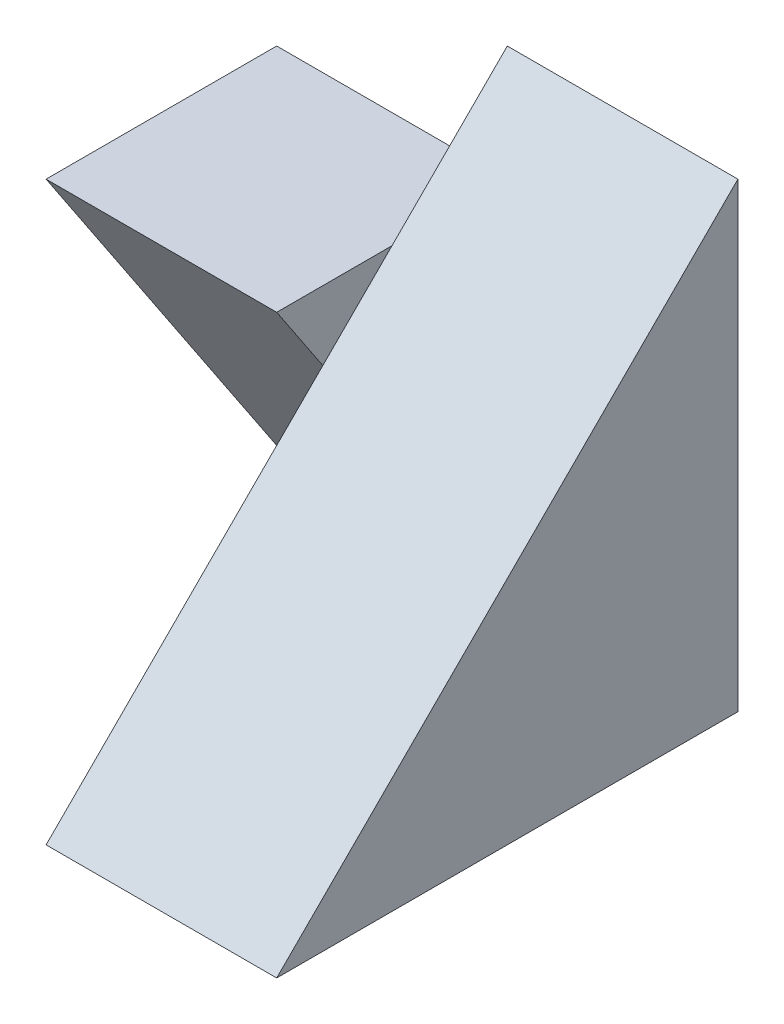
ISO-10303-21;
HEADER;
FILE_DESCRIPTION(('STEP AP214'),'2;1');
FILE_NAME('part.step','',(''),(''),'','','');
FILE_SCHEMA(('AUTOMOTIVE_DESIGN { 1 0 10303 214 1 1 1 1 }'));
ENDSEC;
DATA;
#1=APPLICATION_CONTEXT('core data for automotive mechanical design processes');
#2=APPLICATION_PROTOCOL_DEFINITION('international standard','automotive_design',2000,#1);
#3=PRODUCT_CONTEXT('',#1,'mechanical');
#4=PRODUCT('Part','Part','',(#3));
#5=PRODUCT_RELATED_PRODUCT_CATEGORY('part','',(#4));
#6=PRODUCT_DEFINITION_FORMATION('','',#4);
#7=PRODUCT_DEFINITION_CONTEXT('part definition',#1,'design');
#8=PRODUCT_DEFINITION('design','',#6,#7);
#9=PRODUCT_DEFINITION_SHAPE('','',#8);
#10=(LENGTH_UNIT() NAMED_UNIT(*) SI_UNIT(.MILLI.,.METRE.));
#11=(NAMED_UNIT(*) PLANE_ANGLE_UNIT() SI_UNIT($,.RADIAN.));
#12=(NAMED_UNIT(*) SI_UNIT($,.STERADIAN.) SOLID_ANGLE_UNIT());
#13=UNCERTAINTY_MEASURE_WITH_UNIT(LENGTH_MEASURE(1.E-05),#10,'distance_accuracy_value','');
#14=(GEOMETRIC_REPRESENTATION_CONTEXT(3) GLOBAL_UNCERTAINTY_ASSIGNED_CONTEXT((#13)) GLOBAL_UNIT_ASSIGNED_CONTEXT((#10,
#11,#12)) REPRESENTATION_CONTEXT('',''));
#15=CARTESIAN_POINT('',(0.,0.,0.));
#16=DIRECTION('',(0.,0.,1.));
#17=DIRECTION('',(1.,0.,0.));
#18=AXIS2_PLACEMENT_3D('',#15,#16,#17);
#19=CARTESIAN_POINT('',(0.,0.,0.));
#20=DIRECTION('',(-1.,0.,0.));
#21=DIRECTION('',(0.,0.,1.));
#22=AXIS2_PLACEMENT_3D('',#19,#20,#21);
#23=PLANE('',#22);
#24=DIRECTION('',(0.,0.707106781186548,-0.707106781186548));
#25=VECTOR('',#24,1.);
#26=CARTESIAN_POINT('',(0.,4.,-4.));
#27=LINE('',#26,#25);
#28=CARTESIAN_POINT('',(0.,3.,-3.));
#29=VERTEX_POINT('',#28);
#30=CARTESIAN_POINT('',(0.,4.,-4.));
#31=VERTEX_POINT('',#30);
#32=EDGE_CURVE('E104',#29,#31,#27,.T.);
#33=ORIENTED_EDGE('',*,*,#32,.T.);
#34=DIRECTION('',(0.,1.,0.));
#35=VECTOR('',#34,1.);
#36=CARTESIAN_POINT('',(0.,0.,-4.));
#37=LINE('',#36,#35);
#38=CARTESIAN_POINT('',(0.,3.,-4.));
#39=VERTEX_POINT('',#38);
#40=EDGE_CURVE('E111',#39,#31,#37,.T.);
#41=ORIENTED_EDGE('',*,*,#40,.F.);
#42=DIRECTION('',(0.,0.,-1.));
#43=VECTOR('',#42,1.);
#44=CARTESIAN_POINT('',(0.,3.,-4.));
#45=LINE('',#44,#43);
#46=EDGE_CURVE('E37',#29,#39,#45,.T.);
#47=ORIENTED_EDGE('',*,*,#46,.F.);
#48=EDGE_LOOP('',(#33,#41,#47));
#49=FACE_BOUND('',#48,.T.);
#50=ADVANCED_FACE('F33',(#49),#23,.T.);
#51=CARTESIAN_POINT('',(2.,0.,0.));
#52=DIRECTION('',(0.,1.,0.));
#53=DIRECTION('',(0.,0.,1.));
#54=AXIS2_PLACEMENT_3D('',#51,#52,#53);
#55=PLANE('',#54);
#56=DIRECTION('',(0.,0.,-1.));
#57=VECTOR('',#56,1.);
#58=CARTESIAN_POINT('',(0.,0.,0.));
#59=LINE('',#58,#57);
#60=CARTESIAN_POINT('',(0.,0.,0.));
#61=VERTEX_POINT('',#60);
#62=CARTESIAN_POINT('',(0.,0.,-4.));
#63=VERTEX_POINT('',#62);
#64=EDGE_CURVE('E106',#61,#63,#59,.T.);
#65=ORIENTED_EDGE('',*,*,#64,.T.);
#66=DIRECTION('',(-1.,0.,0.));
#67=VECTOR('',#66,1.);
#68=CARTESIAN_POINT('',(2.,0.,-4.));
#69=LINE('',#68,#67);
#70=CARTESIAN_POINT('',(2.,0.,-4.));
#71=VERTEX_POINT('',#70);
#72=EDGE_CURVE('E43',#71,#63,#69,.T.);
#73=ORIENTED_EDGE('',*,*,#72,.F.);
#74=DIRECTION('',(0.,0.,-1.));
#75=VECTOR('',#74,1.);
#76=CARTESIAN_POINT('',(2.,0.,0.));
#77=LINE('',#76,#75);
#78=CARTESIAN_POINT('',(2.,0.,0.));
#79=VERTEX_POINT('',#78);
#80=EDGE_CURVE('E58',#79,#71,#77,.T.);
#81=ORIENTED_EDGE('',*,*,#80,.F.);
#82=DIRECTION('',(-1.,0.,0.));
#83=VECTOR('',#82,1.);
#84=CARTESIAN_POINT('',(2.,0.,0.));
#85=LINE('',#84,#83);
#86=EDGE_CURVE('E11',#79,#61,#85,.T.);
#87=ORIENTED_EDGE('',*,*,#86,.T.);
#88=EDGE_LOOP('',(#65,#73,#81,#87));
#89=FACE_BOUND('',#88,.T.);
#90=ADVANCED_FACE('F35',(#89),#55,.F.);
#91=CARTESIAN_POINT('',(2.,0.,-4.));
#92=DIRECTION('',(0.,0.,1.));
#93=DIRECTION('',(1.,0.,0.));
#94=AXIS2_PLACEMENT_3D('',#91,#92,#93);
#95=PLANE('',#94);
#96=ORIENTED_EDGE('',*,*,#72,.T.);
#97=DIRECTION('',(-1.,0.,0.));
#98=VECTOR('',#97,1.);
#99=CARTESIAN_POINT('',(0.,0.,-4.));
#100=LINE('',#99,#98);
#101=CARTESIAN_POINT('',(-2.,0.,-4.));
#102=VERTEX_POINT('',#101);
#103=EDGE_CURVE('E140',#63,#102,#100,.T.);
#104=ORIENTED_EDGE('',*,*,#103,.T.);
#105=DIRECTION('',(0.,-1.,0.));
#106=VECTOR('',#105,1.);
#107=CARTESIAN_POINT('',(-2.,0.,-4.));
#108=LINE('',#107,#106);
#109=CARTESIAN_POINT('',(-2.,3.,-4.));
#110=VERTEX_POINT('',#109);
#111=EDGE_CURVE('E131',#110,#102,#108,.T.);
#112=ORIENTED_EDGE('',*,*,#111,.F.);
#113=DIRECTION('',(1.,0.,0.));
#114=VECTOR('',#113,1.);
#115=CARTESIAN_POINT('',(-2.,3.,-4.));
#116=LINE('',#115,#114);
#117=EDGE_CURVE('E132',#110,#39,#116,.T.);
#118=ORIENTED_EDGE('',*,*,#117,.T.);
#119=ORIENTED_EDGE('',*,*,#40,.T.);
#120=DIRECTION('',(-1.,0.,0.));
#121=VECTOR('',#120,1.);
#122=CARTESIAN_POINT('',(2.,4.,-4.));
#123=LINE('',#122,#121);
#124=CARTESIAN_POINT('',(2.,4.,-4.));
#125=VERTEX_POINT('',#124);
#126=EDGE_CURVE('E118',#125,#31,#123,.T.);
#127=ORIENTED_EDGE('',*,*,#126,.F.);
#128=DIRECTION('',(0.,1.,0.));
#129=VECTOR('',#128,1.);
#130=CARTESIAN_POINT('',(2.,0.,-4.));
#131=LINE('',#130,#129);
#132=EDGE_CURVE('E116',#71,#125,#131,.T.);
#133=ORIENTED_EDGE('',*,*,#132,.F.);
#134=EDGE_LOOP('',(#96,#104,#112,#118,#119,#127,#133));
#135=FACE_BOUND('',#134,.T.);
#136=ADVANCED_FACE('F160',(#135),#95,.F.);
#137=CARTESIAN_POINT('',(2.,0.,0.));
#138=DIRECTION('',(-1.,0.,0.));
#139=DIRECTION('',(0.,0.,1.));
#140=AXIS2_PLACEMENT_3D('',#137,#138,#139);
#141=PLANE('',#140);
#142=ORIENTED_EDGE('',*,*,#132,.T.);
#143=DIRECTION('',(0.,0.707106781186548,-0.707106781186548));
#144=VECTOR('',#143,1.);
#145=CARTESIAN_POINT('',(2.,4.,-4.));
#146=LINE('',#145,#144);
#147=EDGE_CURVE('E146',#79,#125,#146,.T.);
#148=ORIENTED_EDGE('',*,*,#147,.F.);
#149=ORIENTED_EDGE('',*,*,#80,.T.);
#150=EDGE_LOOP('',(#142,#148,#149));
#151=FACE_BOUND('',#150,.T.);
#152=ADVANCED_FACE('F166',(#151),#141,.F.);
#153=CARTESIAN_POINT('',(0.,2.4,-2.4));
#154=VERTEX_POINT('',#153);
#155=EDGE_CURVE('E95',#61,#154,#27,.T.);
#156=ORIENTED_EDGE('',*,*,#155,.T.);
#157=DIRECTION('',(0.,-0.832050294337844,-0.554700196225229));
#158=VECTOR('',#157,1.);
#159=CARTESIAN_POINT('',(0.,1.84615384615385,-2.76923076923077));
#160=LINE('',#159,#158);
#161=EDGE_CURVE('E108',#154,#63,#160,.T.);
#162=ORIENTED_EDGE('',*,*,#161,.T.);
#163=ORIENTED_EDGE('',*,*,#64,.F.);
#164=EDGE_LOOP('',(#156,#162,#163));
#165=FACE_BOUND('',#164,.T.);
#166=ADVANCED_FACE('F107',(#165),#23,.T.);
#167=CARTESIAN_POINT('',(-2.,3.,-4.));
#168=DIRECTION('',(0.,-1.,0.));
#169=DIRECTION('',(0.,0.,-1.));
#170=AXIS2_PLACEMENT_3D('',#167,#168,#169);
#171=PLANE('',#170);
#172=CARTESIAN_POINT('',(0.,3.,-2.));
#173=VERTEX_POINT('',#172);
#174=EDGE_CURVE('E129',#173,#29,#45,.T.);
#175=ORIENTED_EDGE('',*,*,#174,.T.);
#176=ORIENTED_EDGE('',*,*,#46,.T.);
#177=ORIENTED_EDGE('',*,*,#117,.F.);
#178=DIRECTION('',(0.,0.,-1.));
#179=VECTOR('',#178,1.);
#180=CARTESIAN_POINT('',(-2.,3.,-4.));
#181=LINE('',#180,#179);
#182=CARTESIAN_POINT('',(-2.,3.,-2.));
#183=VERTEX_POINT('',#182);
#184=EDGE_CURVE('E135',#183,#110,#181,.T.);
#185=ORIENTED_EDGE('',*,*,#184,.F.);
#186=DIRECTION('',(1.,0.,0.));
#187=VECTOR('',#186,1.);
#188=CARTESIAN_POINT('',(-2.,3.,-2.));
#189=LINE('',#188,#187);
#190=EDGE_CURVE('E112',#183,#173,#189,.T.);
#191=ORIENTED_EDGE('',*,*,#190,.T.);
#192=EDGE_LOOP('',(#175,#176,#177,#185,#191));
#193=FACE_BOUND('',#192,.T.);
#194=ADVANCED_FACE('F154',(#193),#171,.F.);
#195=CARTESIAN_POINT('',(-2.,0.,0.));
#196=DIRECTION('',(1.,0.,0.));
#197=DIRECTION('',(0.,0.,-1.));
#198=AXIS2_PLACEMENT_3D('',#195,#196,#197);
#199=PLANE('',#198);
#200=ORIENTED_EDGE('',*,*,#111,.T.);
#201=DIRECTION('',(0.,-0.832050294337844,-0.554700196225229));
#202=VECTOR('',#201,1.);
#203=CARTESIAN_POINT('',(-2.,1.84615384615385,-2.76923076923077));
#204=LINE('',#203,#202);
#205=EDGE_CURVE('E102',#183,#102,#204,.T.);
#206=ORIENTED_EDGE('',*,*,#205,.F.);
#207=ORIENTED_EDGE('',*,*,#184,.T.);
#208=EDGE_LOOP('',(#200,#206,#207));
#209=FACE_BOUND('',#208,.T.);
#210=ADVANCED_FACE('F163',(#209),#199,.F.);
#211=CARTESIAN_POINT('',(0.,1.84615384615385,-2.76923076923077));
#212=DIRECTION('',(0.,0.554700196225229,-0.832050294337844));
#213=DIRECTION('',(0.,0.832050294337844,0.554700196225229));
#214=AXIS2_PLACEMENT_3D('',#211,#212,#213);
#215=PLANE('',#214);
#216=ORIENTED_EDGE('',*,*,#205,.T.);
#217=ORIENTED_EDGE('',*,*,#103,.F.);
#218=ORIENTED_EDGE('',*,*,#161,.F.);
#219=EDGE_CURVE('E143',#173,#154,#160,.T.);
#220=ORIENTED_EDGE('',*,*,#219,.F.);
#221=ORIENTED_EDGE('',*,*,#190,.F.);
#222=EDGE_LOOP('',(#216,#217,#218,#220,#221));
#223=FACE_BOUND('',#222,.T.);
#224=ADVANCED_FACE('F164',(#223),#215,.F.);
#225=CARTESIAN_POINT('',(0.,0.,0.));
#226=DIRECTION('',(1.,0.,0.));
#227=DIRECTION('',(0.,0.,-1.));
#228=AXIS2_PLACEMENT_3D('',#225,#226,#227);
#229=PLANE('',#228);
#230=ORIENTED_EDGE('',*,*,#174,.F.);
#231=ORIENTED_EDGE('',*,*,#219,.T.);
#232=EDGE_CURVE('E99',#154,#29,#27,.T.);
#233=ORIENTED_EDGE('',*,*,#232,.T.);
#234=EDGE_LOOP('',(#230,#231,#233));
#235=FACE_BOUND('',#234,.T.);
#236=ADVANCED_FACE('F150',(#235),#229,.T.);
#237=CARTESIAN_POINT('',(0.,4.,-4.));
#238=DIRECTION('',(0.,-0.707106781186547,-0.707106781186547));
#239=DIRECTION('',(0.,0.707106781186548,-0.707106781186548));
#240=AXIS2_PLACEMENT_3D('',#237,#238,#239);
#241=PLANE('',#240);
#242=ORIENTED_EDGE('',*,*,#147,.T.);
#243=ORIENTED_EDGE('',*,*,#126,.T.);
#244=ORIENTED_EDGE('',*,*,#32,.F.);
#245=ORIENTED_EDGE('',*,*,#232,.F.);
#246=ORIENTED_EDGE('',*,*,#155,.F.);
#247=ORIENTED_EDGE('',*,*,#86,.F.);
#248=EDGE_LOOP('',(#242,#243,#244,#245,#246,#247));
#249=FACE_BOUND('',#248,.T.);
#250=ADVANCED_FACE('F97',(#249),#241,.F.);
#251=CLOSED_SHELL('',(#50,#90,#136,#152,#166,#194,#210,#224,#236,#250));
#252=MANIFOLD_SOLID_BREP('B2',#251);
#253=ADVANCED_BREP_SHAPE_REPRESENTATION('',(#18,#252),#14);
#254=SHAPE_DEFINITION_REPRESENTATION(#9,#253);
ENDSEC;
END-ISO-10303-21;
